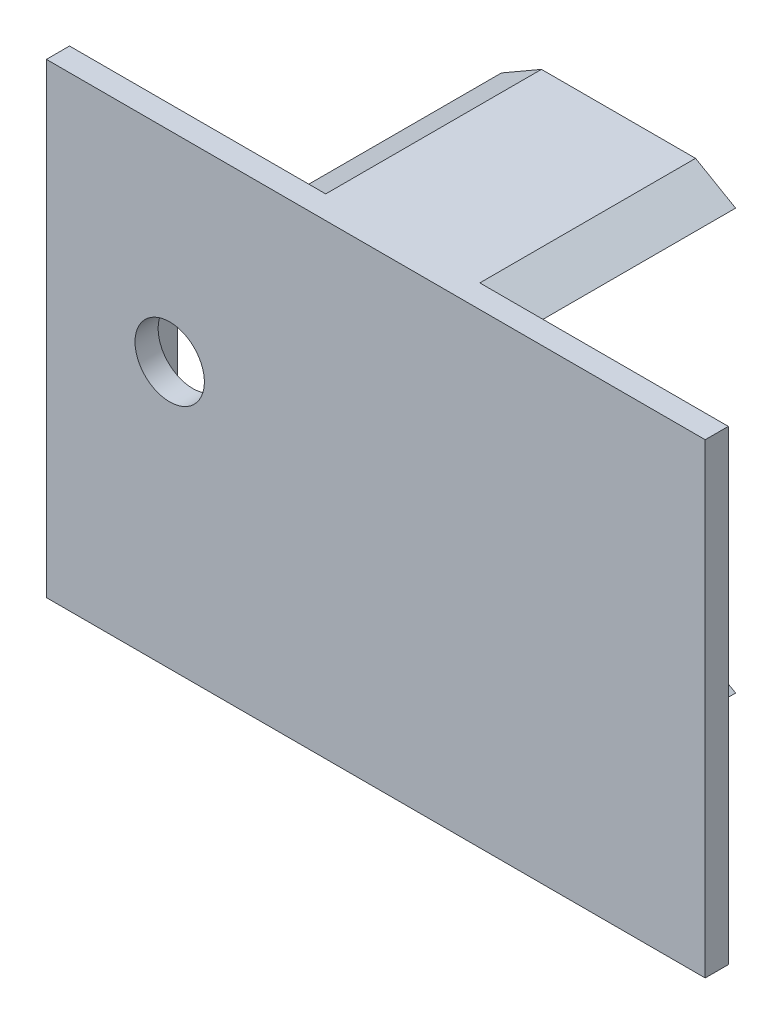
ISO-10303-21;
HEADER;
FILE_DESCRIPTION(('STEP AP214'),'2;1');
FILE_NAME('part.step','',(''),(''),'','','');
FILE_SCHEMA(('AUTOMOTIVE_DESIGN { 1 0 10303 214 1 1 1 1 }'));
ENDSEC;
DATA;
#1=APPLICATION_CONTEXT('core data for automotive mechanical design processes');
#2=APPLICATION_PROTOCOL_DEFINITION('international standard','automotive_design',2000,#1);
#3=PRODUCT_CONTEXT('',#1,'mechanical');
#4=PRODUCT('Part','Part','',(#3));
#5=PRODUCT_RELATED_PRODUCT_CATEGORY('part','',(#4));
#6=PRODUCT_DEFINITION_FORMATION('','',#4);
#7=PRODUCT_DEFINITION_CONTEXT('part definition',#1,'design');
#8=PRODUCT_DEFINITION('design','',#6,#7);
#9=PRODUCT_DEFINITION_SHAPE('','',#8);
#10=(LENGTH_UNIT() NAMED_UNIT(*) SI_UNIT(.MILLI.,.METRE.));
#11=(NAMED_UNIT(*) PLANE_ANGLE_UNIT() SI_UNIT($,.RADIAN.));
#12=(NAMED_UNIT(*) SI_UNIT($,.STERADIAN.) SOLID_ANGLE_UNIT());
#13=UNCERTAINTY_MEASURE_WITH_UNIT(LENGTH_MEASURE(1.E-05),#10,'distance_accuracy_value','');
#14=(GEOMETRIC_REPRESENTATION_CONTEXT(3) GLOBAL_UNCERTAINTY_ASSIGNED_CONTEXT((#13)) GLOBAL_UNIT_ASSIGNED_CONTEXT((#10,
#11,#12)) REPRESENTATION_CONTEXT('',''));
#15=CARTESIAN_POINT('',(0.,0.,0.));
#16=DIRECTION('',(0.,0.,1.));
#17=DIRECTION('',(1.,0.,0.));
#18=AXIS2_PLACEMENT_3D('',#15,#16,#17);
#19=CARTESIAN_POINT('',(0.,0.,0.));
#20=DIRECTION('',(0.,0.,1.));
#21=DIRECTION('',(1.,0.,0.));
#22=AXIS2_PLACEMENT_3D('',#19,#20,#21);
#23=PLANE('',#22);
#24=CARTESIAN_POINT('',(-13.375,2.125,0.));
#25=DIRECTION('',(0.,0.,-1.));
#26=DIRECTION('',(-1.,0.,0.));
#27=AXIS2_PLACEMENT_3D('',#24,#25,#26);
#28=CIRCLE('',#27,2.25);
#29=CARTESIAN_POINT('',(-15.625,2.125,0.));
#30=VERTEX_POINT('',#29);
#31=EDGE_CURVE('E414',#30,#30,#28,.T.);
#32=ORIENTED_EDGE('',*,*,#31,.F.);
#33=EDGE_LOOP('',(#32));
#34=FACE_BOUND('',#33,.T.);
#35=DIRECTION('',(-1.,0.,0.));
#36=VECTOR('',#35,1.);
#37=CARTESIAN_POINT('',(-19.375,-6.925,0.));
#38=LINE('',#37,#36);
#39=CARTESIAN_POINT('',(-19.375,-6.925,0.));
#40=VERTEX_POINT('',#39);
#41=CARTESIAN_POINT('',(-21.375,-6.925,0.));
#42=VERTEX_POINT('',#41);
#43=EDGE_CURVE('E52',#40,#42,#38,.T.);
#44=ORIENTED_EDGE('',*,*,#43,.F.);
#45=DIRECTION('',(0.,-1.,0.));
#46=VECTOR('',#45,1.);
#47=CARTESIAN_POINT('',(-19.375,-6.925,0.));
#48=LINE('',#47,#46);
#49=CARTESIAN_POINT('',(-19.375,0.674999999999999,0.));
#50=VERTEX_POINT('',#49);
#51=EDGE_CURVE('E57',#50,#40,#48,.T.);
#52=ORIENTED_EDGE('',*,*,#51,.F.);
#53=DIRECTION('',(1.,0.,0.));
#54=VECTOR('',#53,1.);
#55=CARTESIAN_POINT('',(-19.375,0.674999999999999,0.));
#56=LINE('',#55,#54);
#57=CARTESIAN_POINT('',(-21.375,0.675,0.));
#58=VERTEX_POINT('',#57);
#59=EDGE_CURVE('E184',#58,#50,#56,.T.);
#60=ORIENTED_EDGE('',*,*,#59,.F.);
#61=DIRECTION('',(0.,1.,0.));
#62=VECTOR('',#61,1.);
#63=CARTESIAN_POINT('',(-21.375,-15.125,0.));
#64=LINE('',#63,#62);
#65=CARTESIAN_POINT('',(-21.375,15.125,0.));
#66=VERTEX_POINT('',#65);
#67=EDGE_CURVE('E181',#58,#66,#64,.T.);
#68=ORIENTED_EDGE('',*,*,#67,.T.);
#69=DIRECTION('',(1.,0.,0.));
#70=VECTOR('',#69,1.);
#71=CARTESIAN_POINT('',(-21.375,15.125,0.));
#72=LINE('',#71,#70);
#73=CARTESIAN_POINT('',(-4.75,15.125,0.));
#74=VERTEX_POINT('',#73);
#75=EDGE_CURVE('E318',#66,#74,#72,.T.);
#76=ORIENTED_EDGE('',*,*,#75,.T.);
#77=DIRECTION('',(0.86602540378444,0.499999999999998,0.));
#78=VECTOR('',#77,1.);
#79=CARTESIAN_POINT('',(-7.34807621135332,13.625,0.));
#80=LINE('',#79,#78);
#81=CARTESIAN_POINT('',(-7.34807621135332,13.625,0.));
#82=VERTEX_POINT('',#81);
#83=EDGE_CURVE('E222',#82,#74,#80,.T.);
#84=ORIENTED_EDGE('',*,*,#83,.F.);
#85=DIRECTION('',(-0.86602540378444,0.499999999999998,0.));
#86=VECTOR('',#85,1.);
#87=CARTESIAN_POINT('',(-4.75,12.125,0.));
#88=LINE('',#87,#86);
#89=CARTESIAN_POINT('',(-4.75,12.125,0.));
#90=VERTEX_POINT('',#89);
#91=EDGE_CURVE('E219',#90,#82,#88,.T.);
#92=ORIENTED_EDGE('',*,*,#91,.F.);
#93=DIRECTION('',(-1.,0.,0.));
#94=VECTOR('',#93,1.);
#95=CARTESIAN_POINT('',(5.25,12.125,0.));
#96=LINE('',#95,#94);
#97=CARTESIAN_POINT('',(5.25,12.125,0.));
#98=VERTEX_POINT('',#97);
#99=EDGE_CURVE('E216',#98,#90,#96,.T.);
#100=ORIENTED_EDGE('',*,*,#99,.F.);
#101=DIRECTION('',(-0.86602540378444,-0.499999999999998,0.));
#102=VECTOR('',#101,1.);
#103=CARTESIAN_POINT('',(7.84807621135332,13.625,0.));
#104=LINE('',#103,#102);
#105=CARTESIAN_POINT('',(7.84807621135332,13.625,0.));
#106=VERTEX_POINT('',#105);
#107=EDGE_CURVE('E202',#106,#98,#104,.T.);
#108=ORIENTED_EDGE('',*,*,#107,.F.);
#109=DIRECTION('',(0.86602540378444,-0.499999999999998,0.));
#110=VECTOR('',#109,1.);
#111=CARTESIAN_POINT('',(5.25,15.125,0.));
#112=LINE('',#111,#110);
#113=CARTESIAN_POINT('',(5.25,15.125,0.));
#114=VERTEX_POINT('',#113);
#115=EDGE_CURVE('E199',#114,#106,#112,.T.);
#116=ORIENTED_EDGE('',*,*,#115,.F.);
#117=CARTESIAN_POINT('',(21.375,15.125,0.));
#118=VERTEX_POINT('',#117);
#119=EDGE_CURVE('E279',#114,#118,#72,.T.);
#120=ORIENTED_EDGE('',*,*,#119,.T.);
#121=DIRECTION('',(0.,1.,0.));
#122=VECTOR('',#121,1.);
#123=CARTESIAN_POINT('',(21.375,-15.125,0.));
#124=LINE('',#123,#122);
#125=CARTESIAN_POINT('',(21.375,-15.125,0.));
#126=VERTEX_POINT('',#125);
#127=EDGE_CURVE('E320',#126,#118,#124,.T.);
#128=ORIENTED_EDGE('',*,*,#127,.F.);
#129=DIRECTION('',(1.,0.,0.));
#130=VECTOR('',#129,1.);
#131=CARTESIAN_POINT('',(-21.375,-15.125,0.));
#132=LINE('',#131,#130);
#133=CARTESIAN_POINT('',(5.25,-15.125,0.));
#134=VERTEX_POINT('',#133);
#135=EDGE_CURVE('E323',#134,#126,#132,.T.);
#136=ORIENTED_EDGE('',*,*,#135,.F.);
#137=DIRECTION('',(-0.86602540378444,-0.499999999999998,0.));
#138=VECTOR('',#137,1.);
#139=CARTESIAN_POINT('',(7.84807621135332,-13.625,0.));
#140=LINE('',#139,#138);
#141=CARTESIAN_POINT('',(7.84807621135332,-13.625,0.));
#142=VERTEX_POINT('',#141);
#143=EDGE_CURVE('E256',#142,#134,#140,.T.);
#144=ORIENTED_EDGE('',*,*,#143,.F.);
#145=DIRECTION('',(0.86602540378444,-0.499999999999998,0.));
#146=VECTOR('',#145,1.);
#147=CARTESIAN_POINT('',(5.25,-12.125,0.));
#148=LINE('',#147,#146);
#149=CARTESIAN_POINT('',(5.25,-12.125,0.));
#150=VERTEX_POINT('',#149);
#151=EDGE_CURVE('E261',#150,#142,#148,.T.);
#152=ORIENTED_EDGE('',*,*,#151,.F.);
#153=DIRECTION('',(1.,0.,0.));
#154=VECTOR('',#153,1.);
#155=CARTESIAN_POINT('',(-4.75,-12.125,0.));
#156=LINE('',#155,#154);
#157=CARTESIAN_POINT('',(-4.75,-12.125,0.));
#158=VERTEX_POINT('',#157);
#159=EDGE_CURVE('E265',#158,#150,#156,.T.);
#160=ORIENTED_EDGE('',*,*,#159,.F.);
#161=DIRECTION('',(0.86602540378444,0.499999999999998,0.));
#162=VECTOR('',#161,1.);
#163=CARTESIAN_POINT('',(-7.34807621135332,-13.625,0.));
#164=LINE('',#163,#162);
#165=CARTESIAN_POINT('',(-7.34807621135332,-13.625,0.));
#166=VERTEX_POINT('',#165);
#167=EDGE_CURVE('E269',#166,#158,#164,.T.);
#168=ORIENTED_EDGE('',*,*,#167,.F.);
#169=DIRECTION('',(-0.86602540378444,0.499999999999998,0.));
#170=VECTOR('',#169,1.);
#171=CARTESIAN_POINT('',(-4.75,-15.125,0.));
#172=LINE('',#171,#170);
#173=CARTESIAN_POINT('',(-4.74999999999998,-15.125,0.));
#174=VERTEX_POINT('',#173);
#175=EDGE_CURVE('E273',#174,#166,#172,.T.);
#176=ORIENTED_EDGE('',*,*,#175,.F.);
#177=CARTESIAN_POINT('',(-21.375,-15.125,0.));
#178=VERTEX_POINT('',#177);
#179=EDGE_CURVE('E324',#178,#174,#132,.T.);
#180=ORIENTED_EDGE('',*,*,#179,.F.);
#181=EDGE_CURVE('E311',#178,#42,#64,.T.);
#182=ORIENTED_EDGE('',*,*,#181,.T.);
#183=EDGE_LOOP('',(#44,#52,#60,#68,#76,#84,#92,#100,#108,#116,#120,#128,#136,#144,#152,#160,
#168,#176,#180,#182));
#184=FACE_BOUND('',#183,.T.);
#185=ADVANCED_FACE('F35',(#34,#184),#23,.F.);
#186=CARTESIAN_POINT('',(-21.375,15.125,1.5));
#187=DIRECTION('',(0.,1.,0.));
#188=DIRECTION('',(0.,0.,1.));
#189=AXIS2_PLACEMENT_3D('',#186,#187,#188);
#190=PLANE('',#189);
#191=ORIENTED_EDGE('',*,*,#75,.F.);
#192=DIRECTION('',(0.,0.,-1.));
#193=VECTOR('',#192,1.);
#194=CARTESIAN_POINT('',(-21.375,15.125,1.5));
#195=LINE('',#194,#193);
#196=CARTESIAN_POINT('',(-21.375,15.125,1.5));
#197=VERTEX_POINT('',#196);
#198=EDGE_CURVE('E12',#197,#66,#195,.T.);
#199=ORIENTED_EDGE('',*,*,#198,.F.);
#200=DIRECTION('',(1.,0.,0.));
#201=VECTOR('',#200,1.);
#202=CARTESIAN_POINT('',(-21.375,15.125,1.5));
#203=LINE('',#202,#201);
#204=CARTESIAN_POINT('',(21.375,15.125,1.5));
#205=VERTEX_POINT('',#204);
#206=EDGE_CURVE('E307',#197,#205,#203,.T.);
#207=ORIENTED_EDGE('',*,*,#206,.T.);
#208=DIRECTION('',(0.,0.,-1.));
#209=VECTOR('',#208,1.);
#210=CARTESIAN_POINT('',(21.375,15.125,1.5));
#211=LINE('',#210,#209);
#212=EDGE_CURVE('E39',#205,#118,#211,.T.);
#213=ORIENTED_EDGE('',*,*,#212,.T.);
#214=ORIENTED_EDGE('',*,*,#119,.F.);
#215=DIRECTION('',(0.,0.,1.));
#216=VECTOR('',#215,1.);
#217=CARTESIAN_POINT('',(5.25,15.125,-29.4894495852543));
#218=LINE('',#217,#216);
#219=CARTESIAN_POINT('',(5.25,15.125,-14.));
#220=VERTEX_POINT('',#219);
#221=EDGE_CURVE('E225',#220,#114,#218,.T.);
#222=ORIENTED_EDGE('',*,*,#221,.F.);
#223=DIRECTION('',(1.,0.,0.));
#224=VECTOR('',#223,1.);
#225=CARTESIAN_POINT('',(-4.75,15.125,-14.));
#226=LINE('',#225,#224);
#227=CARTESIAN_POINT('',(-4.75,15.125,-14.));
#228=VERTEX_POINT('',#227);
#229=EDGE_CURVE('E244',#228,#220,#226,.T.);
#230=ORIENTED_EDGE('',*,*,#229,.F.);
#231=DIRECTION('',(0.,0.,1.));
#232=VECTOR('',#231,1.);
#233=CARTESIAN_POINT('',(-4.75,15.125,-29.4894495852543));
#234=LINE('',#233,#232);
#235=EDGE_CURVE('E228',#228,#74,#234,.T.);
#236=ORIENTED_EDGE('',*,*,#235,.T.);
#237=EDGE_LOOP('',(#191,#199,#207,#213,#214,#222,#230,#236));
#238=FACE_BOUND('',#237,.T.);
#239=ADVANCED_FACE('F37',(#238),#190,.T.);
#240=CARTESIAN_POINT('',(-21.375,-15.125,1.5));
#241=DIRECTION('',(-1.,0.,0.));
#242=DIRECTION('',(0.,0.,1.));
#243=AXIS2_PLACEMENT_3D('',#240,#241,#242);
#244=PLANE('',#243);
#245=ORIENTED_EDGE('',*,*,#181,.F.);
#246=DIRECTION('',(0.,0.,-1.));
#247=VECTOR('',#246,1.);
#248=CARTESIAN_POINT('',(-21.375,-15.125,1.5));
#249=LINE('',#248,#247);
#250=CARTESIAN_POINT('',(-21.375,-15.125,1.5));
#251=VERTEX_POINT('',#250);
#252=EDGE_CURVE('E44',#251,#178,#249,.T.);
#253=ORIENTED_EDGE('',*,*,#252,.F.);
#254=DIRECTION('',(0.,1.,0.));
#255=VECTOR('',#254,1.);
#256=CARTESIAN_POINT('',(-21.375,-15.125,1.5));
#257=LINE('',#256,#255);
#258=EDGE_CURVE('E315',#251,#197,#257,.T.);
#259=ORIENTED_EDGE('',*,*,#258,.T.);
#260=ORIENTED_EDGE('',*,*,#198,.T.);
#261=ORIENTED_EDGE('',*,*,#67,.F.);
#262=DIRECTION('',(0.,0.,1.));
#263=VECTOR('',#262,1.);
#264=CARTESIAN_POINT('',(-21.375,0.675,-24.8587530817554));
#265=LINE('',#264,#263);
#266=CARTESIAN_POINT('',(-21.375,0.675,-5.));
#267=VERTEX_POINT('',#266);
#268=EDGE_CURVE('E173',#267,#58,#265,.T.);
#269=ORIENTED_EDGE('',*,*,#268,.F.);
#270=DIRECTION('',(0.,1.,0.));
#271=VECTOR('',#270,1.);
#272=CARTESIAN_POINT('',(-21.375,-6.925,-5.));
#273=LINE('',#272,#271);
#274=CARTESIAN_POINT('',(-21.375,-6.925,-5.));
#275=VERTEX_POINT('',#274);
#276=EDGE_CURVE('E179',#275,#267,#273,.T.);
#277=ORIENTED_EDGE('',*,*,#276,.F.);
#278=DIRECTION('',(0.,0.,1.));
#279=VECTOR('',#278,1.);
#280=CARTESIAN_POINT('',(-21.375,-6.925,-24.8587530817554));
#281=LINE('',#280,#279);
#282=EDGE_CURVE('E185',#275,#42,#281,.T.);
#283=ORIENTED_EDGE('',*,*,#282,.T.);
#284=EDGE_LOOP('',(#245,#253,#259,#260,#261,#269,#277,#283));
#285=FACE_BOUND('',#284,.T.);
#286=ADVANCED_FACE('F176',(#285),#244,.T.);
#287=CARTESIAN_POINT('',(-21.375,-15.125,1.5));
#288=DIRECTION('',(0.,1.,0.));
#289=DIRECTION('',(0.,0.,1.));
#290=AXIS2_PLACEMENT_3D('',#287,#288,#289);
#291=PLANE('',#290);
#292=ORIENTED_EDGE('',*,*,#179,.T.);
#293=DIRECTION('',(0.,0.,1.));
#294=VECTOR('',#293,1.);
#295=CARTESIAN_POINT('',(-4.75,-15.125,-29.4894495852543));
#296=LINE('',#295,#294);
#297=CARTESIAN_POINT('',(-4.75,-15.125,-14.));
#298=VERTEX_POINT('',#297);
#299=EDGE_CURVE('E246',#298,#174,#296,.T.);
#300=ORIENTED_EDGE('',*,*,#299,.F.);
#301=DIRECTION('',(-1.,0.,0.));
#302=VECTOR('',#301,1.);
#303=CARTESIAN_POINT('',(5.25,-15.125,-14.));
#304=LINE('',#303,#302);
#305=CARTESIAN_POINT('',(5.25,-15.125,-14.));
#306=VERTEX_POINT('',#305);
#307=EDGE_CURVE('E292',#306,#298,#304,.T.);
#308=ORIENTED_EDGE('',*,*,#307,.F.);
#309=DIRECTION('',(0.,0.,1.));
#310=VECTOR('',#309,1.);
#311=CARTESIAN_POINT('',(5.25,-15.125,-29.4894495852543));
#312=LINE('',#311,#310);
#313=EDGE_CURVE('E259',#306,#134,#312,.T.);
#314=ORIENTED_EDGE('',*,*,#313,.T.);
#315=ORIENTED_EDGE('',*,*,#135,.T.);
#316=DIRECTION('',(0.,0.,-1.));
#317=VECTOR('',#316,1.);
#318=CARTESIAN_POINT('',(21.375,-15.125,1.5));
#319=LINE('',#318,#317);
#320=CARTESIAN_POINT('',(21.375,-15.125,1.5));
#321=VERTEX_POINT('',#320);
#322=EDGE_CURVE('E328',#321,#126,#319,.T.);
#323=ORIENTED_EDGE('',*,*,#322,.F.);
#324=DIRECTION('',(1.,0.,0.));
#325=VECTOR('',#324,1.);
#326=CARTESIAN_POINT('',(-21.375,-15.125,1.5));
#327=LINE('',#326,#325);
#328=EDGE_CURVE('E313',#251,#321,#327,.T.);
#329=ORIENTED_EDGE('',*,*,#328,.F.);
#330=ORIENTED_EDGE('',*,*,#252,.T.);
#331=EDGE_LOOP('',(#292,#300,#308,#314,#315,#323,#329,#330));
#332=FACE_BOUND('',#331,.T.);
#333=ADVANCED_FACE('F362',(#332),#291,.F.);
#334=CARTESIAN_POINT('',(21.375,-15.125,1.5));
#335=DIRECTION('',(-1.,0.,0.));
#336=DIRECTION('',(0.,0.,1.));
#337=AXIS2_PLACEMENT_3D('',#334,#335,#336);
#338=PLANE('',#337);
#339=ORIENTED_EDGE('',*,*,#127,.T.);
#340=ORIENTED_EDGE('',*,*,#212,.F.);
#341=DIRECTION('',(0.,1.,0.));
#342=VECTOR('',#341,1.);
#343=CARTESIAN_POINT('',(21.375,-15.125,1.5));
#344=LINE('',#343,#342);
#345=EDGE_CURVE('E310',#321,#205,#344,.T.);
#346=ORIENTED_EDGE('',*,*,#345,.F.);
#347=ORIENTED_EDGE('',*,*,#322,.T.);
#348=EDGE_LOOP('',(#339,#340,#346,#347));
#349=FACE_BOUND('',#348,.T.);
#350=ADVANCED_FACE('F341',(#349),#338,.F.);
#351=CARTESIAN_POINT('',(0.,0.,1.5));
#352=DIRECTION('',(0.,0.,1.));
#353=DIRECTION('',(1.,0.,0.));
#354=AXIS2_PLACEMENT_3D('',#351,#352,#353);
#355=PLANE('',#354);
#356=CARTESIAN_POINT('',(-13.375,2.125,1.5));
#357=DIRECTION('',(0.,0.,-1.));
#358=DIRECTION('',(-1.,0.,0.));
#359=AXIS2_PLACEMENT_3D('',#356,#357,#358);
#360=CIRCLE('',#359,2.25);
#361=CARTESIAN_POINT('',(-15.625,2.125,1.5));
#362=VERTEX_POINT('',#361);
#363=EDGE_CURVE('E212',#362,#362,#360,.T.);
#364=ORIENTED_EDGE('',*,*,#363,.T.);
#365=EDGE_LOOP('',(#364));
#366=FACE_BOUND('',#365,.T.);
#367=ORIENTED_EDGE('',*,*,#206,.F.);
#368=ORIENTED_EDGE('',*,*,#258,.F.);
#369=ORIENTED_EDGE('',*,*,#328,.T.);
#370=ORIENTED_EDGE('',*,*,#345,.T.);
#371=EDGE_LOOP('',(#367,#368,#369,#370));
#372=FACE_BOUND('',#371,.T.);
#373=ADVANCED_FACE('F358',(#366,#372),#355,.T.);
#374=CARTESIAN_POINT('',(-4.75,-15.125,-29.4894495852543));
#375=DIRECTION('',(0.499999999999998,0.86602540378444,0.));
#376=DIRECTION('',(-0.86602540378444,0.499999999999998,0.));
#377=AXIS2_PLACEMENT_3D('',#374,#375,#376);
#378=PLANE('',#377);
#379=DIRECTION('',(-0.86602540378444,0.499999999999998,0.));
#380=VECTOR('',#379,1.);
#381=CARTESIAN_POINT('',(-4.75,-15.125,-14.));
#382=LINE('',#381,#380);
#383=CARTESIAN_POINT('',(-7.34807621135332,-13.625,-14.));
#384=VERTEX_POINT('',#383);
#385=EDGE_CURVE('E289',#298,#384,#382,.T.);
#386=ORIENTED_EDGE('',*,*,#385,.F.);
#387=ORIENTED_EDGE('',*,*,#299,.T.);
#388=ORIENTED_EDGE('',*,*,#175,.T.);
#389=DIRECTION('',(0.,0.,1.));
#390=VECTOR('',#389,1.);
#391=CARTESIAN_POINT('',(-7.34807621135332,-13.625,-29.4894495852543));
#392=LINE('',#391,#390);
#393=EDGE_CURVE('E272',#384,#166,#392,.T.);
#394=ORIENTED_EDGE('',*,*,#393,.F.);
#395=EDGE_LOOP('',(#386,#387,#388,#394));
#396=FACE_BOUND('',#395,.T.);
#397=ADVANCED_FACE('F378',(#396),#378,.F.);
#398=CARTESIAN_POINT('',(-7.34807621135332,-13.625,-29.4894495852543));
#399=DIRECTION('',(0.499999999999998,-0.86602540378444,0.));
#400=DIRECTION('',(0.86602540378444,0.499999999999998,0.));
#401=AXIS2_PLACEMENT_3D('',#398,#399,#400);
#402=PLANE('',#401);
#403=DIRECTION('',(0.86602540378444,0.499999999999998,0.));
#404=VECTOR('',#403,1.);
#405=CARTESIAN_POINT('',(-7.34807621135332,-13.625,-14.));
#406=LINE('',#405,#404);
#407=CARTESIAN_POINT('',(-4.75,-12.125,-14.));
#408=VERTEX_POINT('',#407);
#409=EDGE_CURVE('E286',#384,#408,#406,.T.);
#410=ORIENTED_EDGE('',*,*,#409,.F.);
#411=ORIENTED_EDGE('',*,*,#393,.T.);
#412=ORIENTED_EDGE('',*,*,#167,.T.);
#413=DIRECTION('',(0.,0.,1.));
#414=VECTOR('',#413,1.);
#415=CARTESIAN_POINT('',(-4.75,-12.125,-29.4894495852543));
#416=LINE('',#415,#414);
#417=EDGE_CURVE('E268',#408,#158,#416,.T.);
#418=ORIENTED_EDGE('',*,*,#417,.F.);
#419=EDGE_LOOP('',(#410,#411,#412,#418));
#420=FACE_BOUND('',#419,.T.);
#421=ADVANCED_FACE('F374',(#420),#402,.F.);
#422=CARTESIAN_POINT('',(-4.75,-12.125,-29.4894495852543));
#423=DIRECTION('',(0.,-1.,0.));
#424=DIRECTION('',(0.,0.,-1.));
#425=AXIS2_PLACEMENT_3D('',#422,#423,#424);
#426=PLANE('',#425);
#427=DIRECTION('',(1.,0.,0.));
#428=VECTOR('',#427,1.);
#429=CARTESIAN_POINT('',(-4.75,-12.125,-14.));
#430=LINE('',#429,#428);
#431=CARTESIAN_POINT('',(5.25,-12.125,-14.));
#432=VERTEX_POINT('',#431);
#433=EDGE_CURVE('E283',#408,#432,#430,.T.);
#434=ORIENTED_EDGE('',*,*,#433,.F.);
#435=ORIENTED_EDGE('',*,*,#417,.T.);
#436=ORIENTED_EDGE('',*,*,#159,.T.);
#437=DIRECTION('',(0.,0.,1.));
#438=VECTOR('',#437,1.);
#439=CARTESIAN_POINT('',(5.25,-12.125,-29.4894495852543));
#440=LINE('',#439,#438);
#441=EDGE_CURVE('E264',#432,#150,#440,.T.);
#442=ORIENTED_EDGE('',*,*,#441,.F.);
#443=EDGE_LOOP('',(#434,#435,#436,#442));
#444=FACE_BOUND('',#443,.T.);
#445=ADVANCED_FACE('F371',(#444),#426,.F.);
#446=CARTESIAN_POINT('',(5.25,-12.125,-29.4894495852543));
#447=DIRECTION('',(-0.499999999999998,-0.86602540378444,0.));
#448=DIRECTION('',(0.86602540378444,-0.499999999999998,0.));
#449=AXIS2_PLACEMENT_3D('',#446,#447,#448);
#450=PLANE('',#449);
#451=DIRECTION('',(0.86602540378444,-0.499999999999998,0.));
#452=VECTOR('',#451,1.);
#453=CARTESIAN_POINT('',(5.25,-12.125,-14.));
#454=LINE('',#453,#452);
#455=CARTESIAN_POINT('',(7.84807621135332,-13.625,-14.));
#456=VERTEX_POINT('',#455);
#457=EDGE_CURVE('E280',#432,#456,#454,.T.);
#458=ORIENTED_EDGE('',*,*,#457,.F.);
#459=ORIENTED_EDGE('',*,*,#441,.T.);
#460=ORIENTED_EDGE('',*,*,#151,.T.);
#461=DIRECTION('',(0.,0.,1.));
#462=VECTOR('',#461,1.);
#463=CARTESIAN_POINT('',(7.84807621135332,-13.625,-29.4894495852543));
#464=LINE('',#463,#462);
#465=EDGE_CURVE('E260',#456,#142,#464,.T.);
#466=ORIENTED_EDGE('',*,*,#465,.F.);
#467=EDGE_LOOP('',(#458,#459,#460,#466));
#468=FACE_BOUND('',#467,.T.);
#469=ADVANCED_FACE('F369',(#468),#450,.F.);
#470=CARTESIAN_POINT('',(7.84807621135332,-13.625,-29.4894495852543));
#471=DIRECTION('',(-0.499999999999998,0.86602540378444,0.));
#472=DIRECTION('',(-0.86602540378444,-0.499999999999998,0.));
#473=AXIS2_PLACEMENT_3D('',#470,#471,#472);
#474=PLANE('',#473);
#475=DIRECTION('',(-0.86602540378444,-0.499999999999998,0.));
#476=VECTOR('',#475,1.);
#477=CARTESIAN_POINT('',(7.84807621135332,-13.625,-14.));
#478=LINE('',#477,#476);
#479=EDGE_CURVE('E276',#456,#306,#478,.T.);
#480=ORIENTED_EDGE('',*,*,#479,.F.);
#481=ORIENTED_EDGE('',*,*,#465,.T.);
#482=ORIENTED_EDGE('',*,*,#143,.T.);
#483=ORIENTED_EDGE('',*,*,#313,.F.);
#484=EDGE_LOOP('',(#480,#481,#482,#483));
#485=FACE_BOUND('',#484,.T.);
#486=ADVANCED_FACE('F365',(#485),#474,.F.);
#487=CARTESIAN_POINT('',(0.25,0.,-14.));
#488=DIRECTION('',(0.,0.,-1.));
#489=DIRECTION('',(0.,1.,0.));
#490=AXIS2_PLACEMENT_3D('',#487,#488,#489);
#491=PLANE('',#490);
#492=ORIENTED_EDGE('',*,*,#307,.T.);
#493=ORIENTED_EDGE('',*,*,#385,.T.);
#494=ORIENTED_EDGE('',*,*,#409,.T.);
#495=ORIENTED_EDGE('',*,*,#433,.T.);
#496=ORIENTED_EDGE('',*,*,#457,.T.);
#497=ORIENTED_EDGE('',*,*,#479,.T.);
#498=EDGE_LOOP('',(#492,#493,#494,#495,#496,#497));
#499=FACE_BOUND('',#498,.T.);
#500=ADVANCED_FACE('F380',(#499),#491,.T.);
#501=CARTESIAN_POINT('',(5.25,15.125,-29.4894495852543));
#502=DIRECTION('',(-0.499999999999998,-0.86602540378444,0.));
#503=DIRECTION('',(0.86602540378444,-0.499999999999998,0.));
#504=AXIS2_PLACEMENT_3D('',#501,#502,#503);
#505=PLANE('',#504);
#506=DIRECTION('',(0.86602540378444,-0.499999999999998,0.));
#507=VECTOR('',#506,1.);
#508=CARTESIAN_POINT('',(5.25,15.125,-14.));
#509=LINE('',#508,#507);
#510=CARTESIAN_POINT('',(7.84807621135332,13.625,-14.));
#511=VERTEX_POINT('',#510);
#512=EDGE_CURVE('E247',#220,#511,#509,.T.);
#513=ORIENTED_EDGE('',*,*,#512,.F.);
#514=ORIENTED_EDGE('',*,*,#221,.T.);
#515=ORIENTED_EDGE('',*,*,#115,.T.);
#516=DIRECTION('',(0.,0.,1.));
#517=VECTOR('',#516,1.);
#518=CARTESIAN_POINT('',(7.84807621135332,13.625,-29.4894495852543));
#519=LINE('',#518,#517);
#520=EDGE_CURVE('E240',#511,#106,#519,.T.);
#521=ORIENTED_EDGE('',*,*,#520,.F.);
#522=EDGE_LOOP('',(#513,#514,#515,#521));
#523=FACE_BOUND('',#522,.T.);
#524=ADVANCED_FACE('F345',(#523),#505,.F.);
#525=CARTESIAN_POINT('',(7.84807621135332,13.625,-29.4894495852543));
#526=DIRECTION('',(-0.499999999999998,0.86602540378444,0.));
#527=DIRECTION('',(-0.86602540378444,-0.499999999999998,0.));
#528=AXIS2_PLACEMENT_3D('',#525,#526,#527);
#529=PLANE('',#528);
#530=DIRECTION('',(-0.86602540378444,-0.499999999999998,0.));
#531=VECTOR('',#530,1.);
#532=CARTESIAN_POINT('',(7.84807621135332,13.625,-14.));
#533=LINE('',#532,#531);
#534=CARTESIAN_POINT('',(5.25,12.125,-14.));
#535=VERTEX_POINT('',#534);
#536=EDGE_CURVE('E253',#511,#535,#533,.T.);
#537=ORIENTED_EDGE('',*,*,#536,.F.);
#538=ORIENTED_EDGE('',*,*,#520,.T.);
#539=ORIENTED_EDGE('',*,*,#107,.T.);
#540=DIRECTION('',(0.,0.,1.));
#541=VECTOR('',#540,1.);
#542=CARTESIAN_POINT('',(5.25,12.125,-29.4894495852543));
#543=LINE('',#542,#541);
#544=EDGE_CURVE('E237',#535,#98,#543,.T.);
#545=ORIENTED_EDGE('',*,*,#544,.F.);
#546=EDGE_LOOP('',(#537,#538,#539,#545));
#547=FACE_BOUND('',#546,.T.);
#548=ADVANCED_FACE('F387',(#547),#529,.F.);
#549=CARTESIAN_POINT('',(5.25,12.125,-29.4894495852543));
#550=DIRECTION('',(0.,1.,0.));
#551=DIRECTION('',(0.,0.,1.));
#552=AXIS2_PLACEMENT_3D('',#549,#550,#551);
#553=PLANE('',#552);
#554=DIRECTION('',(-1.,0.,0.));
#555=VECTOR('',#554,1.);
#556=CARTESIAN_POINT('',(5.25,12.125,-14.));
#557=LINE('',#556,#555);
#558=CARTESIAN_POINT('',(-4.75,12.125,-14.));
#559=VERTEX_POINT('',#558);
#560=EDGE_CURVE('E251',#535,#559,#557,.T.);
#561=ORIENTED_EDGE('',*,*,#560,.F.);
#562=ORIENTED_EDGE('',*,*,#544,.T.);
#563=ORIENTED_EDGE('',*,*,#99,.T.);
#564=DIRECTION('',(0.,0.,1.));
#565=VECTOR('',#564,1.);
#566=CARTESIAN_POINT('',(-4.75,12.125,-29.4894495852543));
#567=LINE('',#566,#565);
#568=EDGE_CURVE('E234',#559,#90,#567,.T.);
#569=ORIENTED_EDGE('',*,*,#568,.F.);
#570=EDGE_LOOP('',(#561,#562,#563,#569));
#571=FACE_BOUND('',#570,.T.);
#572=ADVANCED_FACE('F442',(#571),#553,.F.);
#573=CARTESIAN_POINT('',(-4.75,12.125,-29.4894495852543));
#574=DIRECTION('',(0.499999999999998,0.86602540378444,0.));
#575=DIRECTION('',(-0.86602540378444,0.499999999999998,0.));
#576=AXIS2_PLACEMENT_3D('',#573,#574,#575);
#577=PLANE('',#576);
#578=DIRECTION('',(-0.86602540378444,0.499999999999998,0.));
#579=VECTOR('',#578,1.);
#580=CARTESIAN_POINT('',(-4.75,12.125,-14.));
#581=LINE('',#580,#579);
#582=CARTESIAN_POINT('',(-7.34807621135332,13.625,-14.));
#583=VERTEX_POINT('',#582);
#584=EDGE_CURVE('E249',#559,#583,#581,.T.);
#585=ORIENTED_EDGE('',*,*,#584,.F.);
#586=ORIENTED_EDGE('',*,*,#568,.T.);
#587=ORIENTED_EDGE('',*,*,#91,.T.);
#588=DIRECTION('',(0.,0.,1.));
#589=VECTOR('',#588,1.);
#590=CARTESIAN_POINT('',(-7.34807621135332,13.625,-29.4894495852543));
#591=LINE('',#590,#589);
#592=EDGE_CURVE('E231',#583,#82,#591,.T.);
#593=ORIENTED_EDGE('',*,*,#592,.F.);
#594=EDGE_LOOP('',(#585,#586,#587,#593));
#595=FACE_BOUND('',#594,.T.);
#596=ADVANCED_FACE('F439',(#595),#577,.F.);
#597=CARTESIAN_POINT('',(-7.34807621135332,13.625,-29.4894495852543));
#598=DIRECTION('',(0.499999999999998,-0.86602540378444,0.));
#599=DIRECTION('',(0.86602540378444,0.499999999999998,0.));
#600=AXIS2_PLACEMENT_3D('',#597,#598,#599);
#601=PLANE('',#600);
#602=DIRECTION('',(0.86602540378444,0.499999999999998,0.));
#603=VECTOR('',#602,1.);
#604=CARTESIAN_POINT('',(-7.34807621135332,13.625,-14.));
#605=LINE('',#604,#603);
#606=EDGE_CURVE('E243',#583,#228,#605,.T.);
#607=ORIENTED_EDGE('',*,*,#606,.F.);
#608=ORIENTED_EDGE('',*,*,#592,.T.);
#609=ORIENTED_EDGE('',*,*,#83,.T.);
#610=ORIENTED_EDGE('',*,*,#235,.F.);
#611=EDGE_LOOP('',(#607,#608,#609,#610));
#612=FACE_BOUND('',#611,.T.);
#613=ADVANCED_FACE('F355',(#612),#601,.F.);
#614=CARTESIAN_POINT('',(0.25,0.,-14.));
#615=DIRECTION('',(0.,0.,-1.));
#616=DIRECTION('',(0.,1.,0.));
#617=AXIS2_PLACEMENT_3D('',#614,#615,#616);
#618=PLANE('',#617);
#619=ORIENTED_EDGE('',*,*,#229,.T.);
#620=ORIENTED_EDGE('',*,*,#512,.T.);
#621=ORIENTED_EDGE('',*,*,#536,.T.);
#622=ORIENTED_EDGE('',*,*,#560,.T.);
#623=ORIENTED_EDGE('',*,*,#584,.T.);
#624=ORIENTED_EDGE('',*,*,#606,.T.);
#625=EDGE_LOOP('',(#619,#620,#621,#622,#623,#624));
#626=FACE_BOUND('',#625,.T.);
#627=ADVANCED_FACE('F349',(#626),#618,.T.);
#628=CARTESIAN_POINT('',(-19.375,-6.925,-24.8587530817554));
#629=DIRECTION('',(-1.,0.,0.));
#630=DIRECTION('',(0.,0.,1.));
#631=AXIS2_PLACEMENT_3D('',#628,#629,#630);
#632=PLANE('',#631);
#633=DIRECTION('',(0.,-1.,0.));
#634=VECTOR('',#633,1.);
#635=CARTESIAN_POINT('',(-19.375,-6.925,-5.));
#636=LINE('',#635,#634);
#637=CARTESIAN_POINT('',(-19.375,0.674999999999999,-5.));
#638=VERTEX_POINT('',#637);
#639=CARTESIAN_POINT('',(-19.375,-6.925,-5.));
#640=VERTEX_POINT('',#639);
#641=EDGE_CURVE('E194',#638,#640,#636,.T.);
#642=ORIENTED_EDGE('',*,*,#641,.F.);
#643=DIRECTION('',(0.,0.,1.));
#644=VECTOR('',#643,1.);
#645=CARTESIAN_POINT('',(-19.375,0.674999999999999,-24.8587530817554));
#646=LINE('',#645,#644);
#647=EDGE_CURVE('E190',#638,#50,#646,.T.);
#648=ORIENTED_EDGE('',*,*,#647,.T.);
#649=ORIENTED_EDGE('',*,*,#51,.T.);
#650=DIRECTION('',(0.,0.,1.));
#651=VECTOR('',#650,1.);
#652=CARTESIAN_POINT('',(-19.375,-6.925,-24.8587530817554));
#653=LINE('',#652,#651);
#654=EDGE_CURVE('E209',#640,#40,#653,.T.);
#655=ORIENTED_EDGE('',*,*,#654,.F.);
#656=EDGE_LOOP('',(#642,#648,#649,#655));
#657=FACE_BOUND('',#656,.T.);
#658=ADVANCED_FACE('F423',(#657),#632,.F.);
#659=CARTESIAN_POINT('',(-19.375,-6.925,-24.8587530817554));
#660=DIRECTION('',(0.,1.,0.));
#661=DIRECTION('',(0.,0.,1.));
#662=AXIS2_PLACEMENT_3D('',#659,#660,#661);
#663=PLANE('',#662);
#664=DIRECTION('',(-1.,0.,0.));
#665=VECTOR('',#664,1.);
#666=CARTESIAN_POINT('',(-19.375,-6.925,-5.));
#667=LINE('',#666,#665);
#668=EDGE_CURVE('E198',#640,#275,#667,.T.);
#669=ORIENTED_EDGE('',*,*,#668,.F.);
#670=ORIENTED_EDGE('',*,*,#654,.T.);
#671=ORIENTED_EDGE('',*,*,#43,.T.);
#672=ORIENTED_EDGE('',*,*,#282,.F.);
#673=EDGE_LOOP('',(#669,#670,#671,#672));
#674=FACE_BOUND('',#673,.T.);
#675=ADVANCED_FACE('F420',(#674),#663,.F.);
#676=CARTESIAN_POINT('',(-19.375,0.674999999999999,-24.8587530817554));
#677=DIRECTION('',(0.,-1.,0.));
#678=DIRECTION('',(1.,0.,0.));
#679=AXIS2_PLACEMENT_3D('',#676,#677,#678);
#680=PLANE('',#679);
#681=DIRECTION('',(1.,0.,0.));
#682=VECTOR('',#681,1.);
#683=CARTESIAN_POINT('',(-19.375,0.674999999999999,-5.));
#684=LINE('',#683,#682);
#685=EDGE_CURVE('E188',#267,#638,#684,.T.);
#686=ORIENTED_EDGE('',*,*,#685,.F.);
#687=ORIENTED_EDGE('',*,*,#268,.T.);
#688=ORIENTED_EDGE('',*,*,#59,.T.);
#689=ORIENTED_EDGE('',*,*,#647,.F.);
#690=EDGE_LOOP('',(#686,#687,#688,#689));
#691=FACE_BOUND('',#690,.T.);
#692=ADVANCED_FACE('F189',(#691),#680,.F.);
#693=CARTESIAN_POINT('',(0.25,0.,-5.));
#694=DIRECTION('',(0.,0.,-1.));
#695=DIRECTION('',(0.,1.,0.));
#696=AXIS2_PLACEMENT_3D('',#693,#694,#695);
#697=PLANE('',#696);
#698=ORIENTED_EDGE('',*,*,#685,.T.);
#699=ORIENTED_EDGE('',*,*,#641,.T.);
#700=ORIENTED_EDGE('',*,*,#668,.T.);
#701=ORIENTED_EDGE('',*,*,#276,.T.);
#702=EDGE_LOOP('',(#698,#699,#700,#701));
#703=FACE_BOUND('',#702,.T.);
#704=ADVANCED_FACE('F197',(#703),#697,.T.);
#705=CARTESIAN_POINT('',(-13.375,2.125,1.5));
#706=DIRECTION('',(0.,0.,-1.));
#707=DIRECTION('',(-1.,0.,0.));
#708=AXIS2_PLACEMENT_3D('',#705,#706,#707);
#709=CYLINDRICAL_SURFACE('',#708,2.25);
#710=ORIENTED_EDGE('',*,*,#363,.F.);
#711=EDGE_LOOP('',(#710));
#712=FACE_BOUND('',#711,.T.);
#713=ORIENTED_EDGE('',*,*,#31,.T.);
#714=EDGE_LOOP('',(#713));
#715=FACE_BOUND('',#714,.T.);
#716=ADVANCED_FACE('F435',(#712,#715),#709,.F.);
#717=CLOSED_SHELL('',(#185,#239,#286,#333,#350,#373,#397,#421,#445,#469,#486,#500,#524,#548,
#572,#596,#613,#627,#658,#675,#692,#704,#716));
#718=MANIFOLD_SOLID_BREP('B2',#717);
#719=ADVANCED_BREP_SHAPE_REPRESENTATION('',(#18,#718),#14);
#720=SHAPE_DEFINITION_REPRESENTATION(#9,#719);
ENDSEC;
END-ISO-10303-21;
